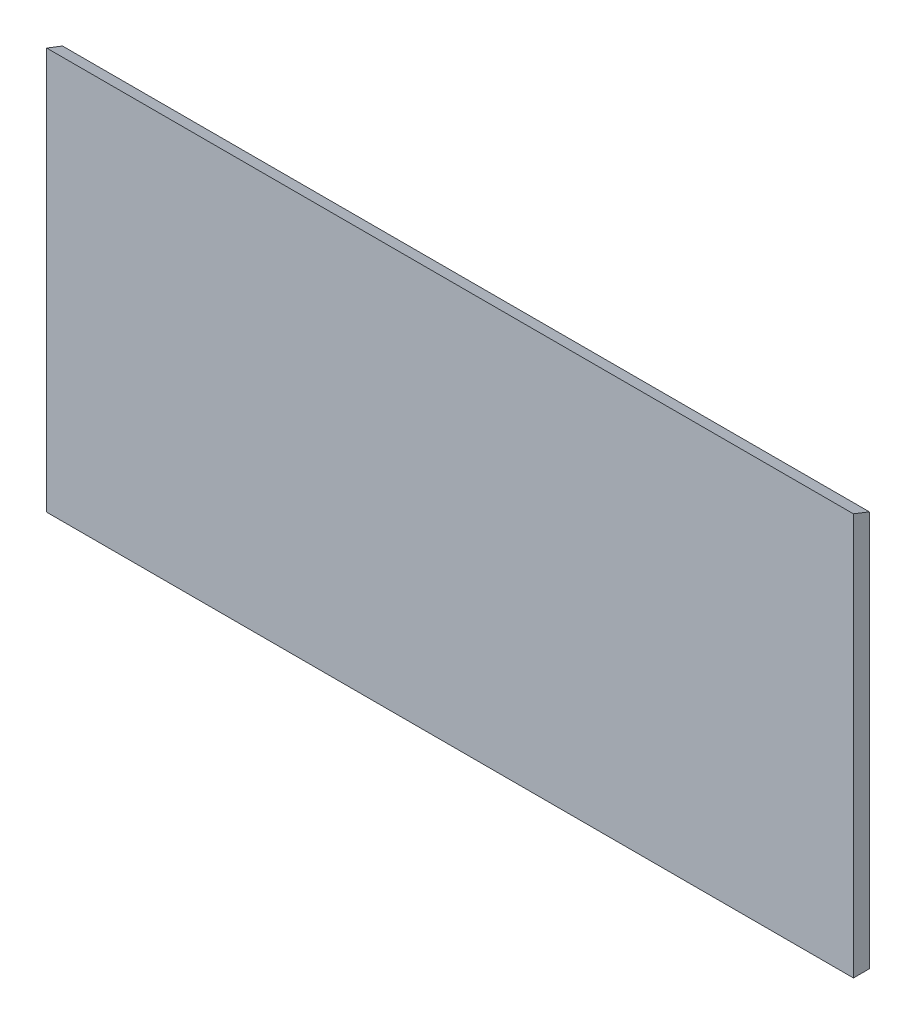
ISO-10303-21;
HEADER;
FILE_DESCRIPTION(('STEP AP214'),'2;1');
FILE_NAME('part.step','',(''),(''),'','','');
FILE_SCHEMA(('AUTOMOTIVE_DESIGN { 1 0 10303 214 1 1 1 1 }'));
ENDSEC;
DATA;
#1=APPLICATION_CONTEXT('core data for automotive mechanical design processes');
#2=APPLICATION_PROTOCOL_DEFINITION('international standard','automotive_design',2000,#1);
#3=PRODUCT_CONTEXT('',#1,'mechanical');
#4=PRODUCT('Part','Part','',(#3));
#5=PRODUCT_RELATED_PRODUCT_CATEGORY('part','',(#4));
#6=PRODUCT_DEFINITION_FORMATION('','',#4);
#7=PRODUCT_DEFINITION_CONTEXT('part definition',#1,'design');
#8=PRODUCT_DEFINITION('design','',#6,#7);
#9=PRODUCT_DEFINITION_SHAPE('','',#8);
#10=(LENGTH_UNIT() NAMED_UNIT(*) SI_UNIT(.MILLI.,.METRE.));
#11=(NAMED_UNIT(*) PLANE_ANGLE_UNIT() SI_UNIT($,.RADIAN.));
#12=(NAMED_UNIT(*) SI_UNIT($,.STERADIAN.) SOLID_ANGLE_UNIT());
#13=UNCERTAINTY_MEASURE_WITH_UNIT(LENGTH_MEASURE(1.E-05),#10,'distance_accuracy_value','');
#14=(GEOMETRIC_REPRESENTATION_CONTEXT(3) GLOBAL_UNCERTAINTY_ASSIGNED_CONTEXT((#13)) GLOBAL_UNIT_ASSIGNED_CONTEXT((#10,
#11,#12)) REPRESENTATION_CONTEXT('',''));
#15=CARTESIAN_POINT('',(0.,0.,0.));
#16=DIRECTION('',(0.,0.,1.));
#17=DIRECTION('',(1.,0.,0.));
#18=AXIS2_PLACEMENT_3D('',#15,#16,#17);
#19=CARTESIAN_POINT('',(-850.,417.,33.45));
#20=DIRECTION('',(1.,0.,0.));
#21=DIRECTION('',(0.,1.,0.));
#22=AXIS2_PLACEMENT_3D('',#19,#20,#21);
#23=PLANE('',#22);
#24=DIRECTION('',(0.,-1.,0.));
#25=VECTOR('',#24,1.);
#26=CARTESIAN_POINT('',(-850.,417.,0.));
#27=LINE('',#26,#25);
#28=CARTESIAN_POINT('',(-850.,417.,0.));
#29=VERTEX_POINT('',#28);
#30=CARTESIAN_POINT('',(-850.,-417.,0.));
#31=VERTEX_POINT('',#30);
#32=EDGE_CURVE('E78',#29,#31,#27,.T.);
#33=ORIENTED_EDGE('',*,*,#32,.T.);
#34=DIRECTION('',(0.,0.,-1.));
#35=VECTOR('',#34,1.);
#36=CARTESIAN_POINT('',(-850.,-417.,33.45));
#37=LINE('',#36,#35);
#38=CARTESIAN_POINT('',(-850.,-417.,33.45));
#39=VERTEX_POINT('',#38);
#40=EDGE_CURVE('E11',#39,#31,#37,.T.);
#41=ORIENTED_EDGE('',*,*,#40,.F.);
#42=DIRECTION('',(0.,-1.,0.));
#43=VECTOR('',#42,1.);
#44=CARTESIAN_POINT('',(-850.,417.,33.45));
#45=LINE('',#44,#43);
#46=CARTESIAN_POINT('',(-850.,430.,33.45));
#47=VERTEX_POINT('',#46);
#48=EDGE_CURVE('E92',#47,#39,#45,.T.);
#49=ORIENTED_EDGE('',*,*,#48,.F.);
#50=DIRECTION('',(0.,-0.36224454916465,-0.932083089965964));
#51=VECTOR('',#50,1.);
#52=CARTESIAN_POINT('',(-850.,430.,33.45));
#53=LINE('',#52,#51);
#54=EDGE_CURVE('E88',#47,#29,#53,.T.);
#55=ORIENTED_EDGE('',*,*,#54,.T.);
#56=EDGE_LOOP('',(#33,#41,#49,#55));
#57=FACE_BOUND('',#56,.T.);
#58=ADVANCED_FACE('F45',(#57),#23,.F.);
#59=CARTESIAN_POINT('',(850.,-417.,33.45));
#60=DIRECTION('',(0.,1.,0.));
#61=DIRECTION('',(-1.,0.,0.));
#62=AXIS2_PLACEMENT_3D('',#59,#60,#61);
#63=PLANE('',#62);
#64=DIRECTION('',(1.,0.,0.));
#65=VECTOR('',#64,1.);
#66=CARTESIAN_POINT('',(850.,-417.,0.));
#67=LINE('',#66,#65);
#68=CARTESIAN_POINT('',(850.,-417.,0.));
#69=VERTEX_POINT('',#68);
#70=EDGE_CURVE('E72',#31,#69,#67,.T.);
#71=ORIENTED_EDGE('',*,*,#70,.T.);
#72=DIRECTION('',(0.,0.,-1.));
#73=VECTOR('',#72,1.);
#74=CARTESIAN_POINT('',(850.,-417.,33.45));
#75=LINE('',#74,#73);
#76=CARTESIAN_POINT('',(850.,-417.,33.45));
#77=VERTEX_POINT('',#76);
#78=EDGE_CURVE('E53',#77,#69,#75,.T.);
#79=ORIENTED_EDGE('',*,*,#78,.F.);
#80=DIRECTION('',(1.,0.,0.));
#81=VECTOR('',#80,1.);
#82=CARTESIAN_POINT('',(850.,-417.,33.45));
#83=LINE('',#82,#81);
#84=EDGE_CURVE('E61',#39,#77,#83,.T.);
#85=ORIENTED_EDGE('',*,*,#84,.F.);
#86=ORIENTED_EDGE('',*,*,#40,.T.);
#87=EDGE_LOOP('',(#71,#79,#85,#86));
#88=FACE_BOUND('',#87,.T.);
#89=ADVANCED_FACE('F120',(#88),#63,.F.);
#90=CARTESIAN_POINT('',(850.,417.,33.45));
#91=DIRECTION('',(-1.,0.,0.));
#92=DIRECTION('',(0.,-1.,0.));
#93=AXIS2_PLACEMENT_3D('',#90,#91,#92);
#94=PLANE('',#93);
#95=DIRECTION('',(0.,1.,0.));
#96=VECTOR('',#95,1.);
#97=CARTESIAN_POINT('',(850.,417.,0.));
#98=LINE('',#97,#96);
#99=CARTESIAN_POINT('',(850.,417.,0.));
#100=VERTEX_POINT('',#99);
#101=EDGE_CURVE('E102',#69,#100,#98,.T.);
#102=ORIENTED_EDGE('',*,*,#101,.T.);
#103=DIRECTION('',(0.,0.36224454916465,0.932083089965964));
#104=VECTOR('',#103,1.);
#105=CARTESIAN_POINT('',(850.,430.,33.45));
#106=LINE('',#105,#104);
#107=CARTESIAN_POINT('',(850.,430.,33.45));
#108=VERTEX_POINT('',#107);
#109=EDGE_CURVE('E101',#100,#108,#106,.T.);
#110=ORIENTED_EDGE('',*,*,#109,.T.);
#111=DIRECTION('',(0.,1.,0.));
#112=VECTOR('',#111,1.);
#113=CARTESIAN_POINT('',(850.,417.,33.45));
#114=LINE('',#113,#112);
#115=EDGE_CURVE('E107',#77,#108,#114,.T.);
#116=ORIENTED_EDGE('',*,*,#115,.F.);
#117=ORIENTED_EDGE('',*,*,#78,.T.);
#118=EDGE_LOOP('',(#102,#110,#116,#117));
#119=FACE_BOUND('',#118,.T.);
#120=ADVANCED_FACE('F115',(#119),#94,.F.);
#121=CARTESIAN_POINT('',(0.,0.,33.45));
#122=DIRECTION('',(0.,0.,-1.));
#123=DIRECTION('',(-1.,0.,0.));
#124=AXIS2_PLACEMENT_3D('',#121,#122,#123);
#125=PLANE('',#124);
#126=ORIENTED_EDGE('',*,*,#48,.T.);
#127=ORIENTED_EDGE('',*,*,#84,.T.);
#128=ORIENTED_EDGE('',*,*,#115,.T.);
#129=DIRECTION('',(1.,0.,0.));
#130=VECTOR('',#129,1.);
#131=CARTESIAN_POINT('',(-885.887358498502,430.,33.45));
#132=LINE('',#131,#130);
#133=EDGE_CURVE('E96',#47,#108,#132,.T.);
#134=ORIENTED_EDGE('',*,*,#133,.F.);
#135=EDGE_LOOP('',(#126,#127,#128,#134));
#136=FACE_BOUND('',#135,.T.);
#137=ADVANCED_FACE('F119',(#136),#125,.F.);
#138=CARTESIAN_POINT('',(0.,0.,0.));
#139=DIRECTION('',(0.,0.,-1.));
#140=DIRECTION('',(-1.,0.,0.));
#141=AXIS2_PLACEMENT_3D('',#138,#139,#140);
#142=PLANE('',#141);
#143=ORIENTED_EDGE('',*,*,#32,.F.);
#144=DIRECTION('',(-1.,0.,0.));
#145=VECTOR('',#144,1.);
#146=CARTESIAN_POINT('',(850.,417.,0.));
#147=LINE('',#146,#145);
#148=EDGE_CURVE('E84',#100,#29,#147,.T.);
#149=ORIENTED_EDGE('',*,*,#148,.F.);
#150=ORIENTED_EDGE('',*,*,#101,.F.);
#151=ORIENTED_EDGE('',*,*,#70,.F.);
#152=EDGE_LOOP('',(#143,#149,#150,#151));
#153=FACE_BOUND('',#152,.T.);
#154=ADVANCED_FACE('F80',(#153),#142,.T.);
#155=CARTESIAN_POINT('',(-885.887358498502,430.,33.45));
#156=DIRECTION('',(0.,0.932083089965964,-0.36224454916465));
#157=DIRECTION('',(0.,0.36224454916465,0.932083089965964));
#158=AXIS2_PLACEMENT_3D('',#155,#156,#157);
#159=PLANE('',#158);
#160=ORIENTED_EDGE('',*,*,#54,.F.);
#161=ORIENTED_EDGE('',*,*,#133,.T.);
#162=ORIENTED_EDGE('',*,*,#109,.F.);
#163=ORIENTED_EDGE('',*,*,#148,.T.);
#164=EDGE_LOOP('',(#160,#161,#162,#163));
#165=FACE_BOUND('',#164,.T.);
#166=ADVANCED_FACE('F99',(#165),#159,.T.);
#167=CLOSED_SHELL('',(#58,#89,#120,#137,#154,#166));
#168=MANIFOLD_SOLID_BREP('B2',#167);
#169=ADVANCED_BREP_SHAPE_REPRESENTATION('',(#18,#168),#14);
#170=SHAPE_DEFINITION_REPRESENTATION(#9,#169);
ENDSEC;
END-ISO-10303-21;
